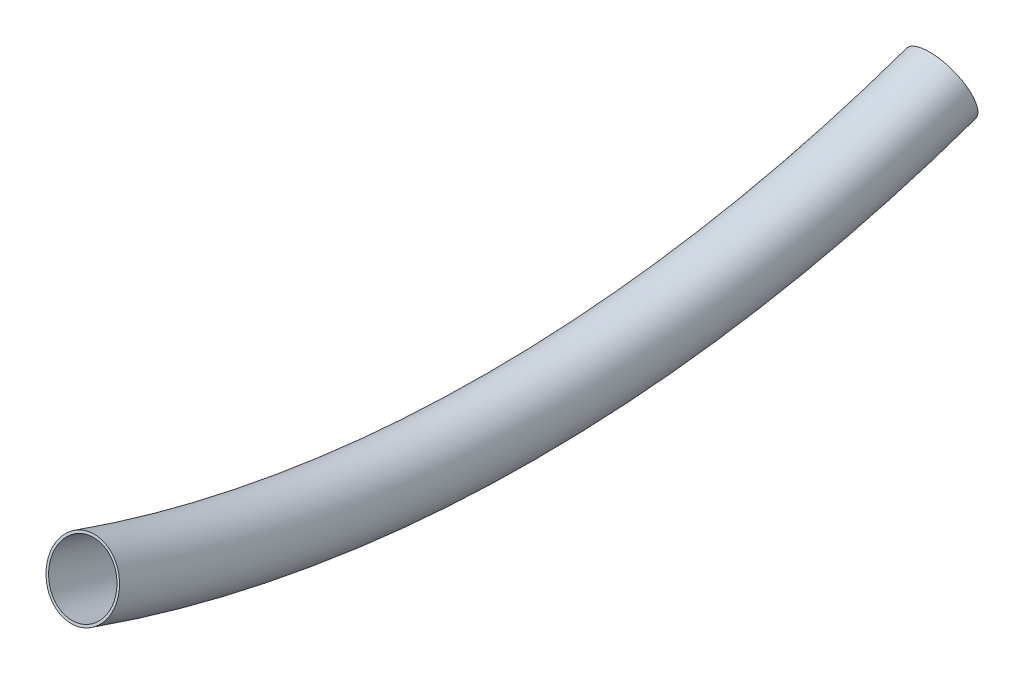
ISO-10303-21;
HEADER;
FILE_DESCRIPTION(('STEP AP214'),'2;1');
FILE_NAME('part.step','',(''),(''),'','','');
FILE_SCHEMA(('AUTOMOTIVE_DESIGN { 1 0 10303 214 1 1 1 1 }'));
ENDSEC;
DATA;
#1=APPLICATION_CONTEXT('core data for automotive mechanical design processes');
#2=APPLICATION_PROTOCOL_DEFINITION('international standard','automotive_design',2000,#1);
#3=PRODUCT_CONTEXT('',#1,'mechanical');
#4=PRODUCT('Part','Part','',(#3));
#5=PRODUCT_RELATED_PRODUCT_CATEGORY('part','',(#4));
#6=PRODUCT_DEFINITION_FORMATION('','',#4);
#7=PRODUCT_DEFINITION_CONTEXT('part definition',#1,'design');
#8=PRODUCT_DEFINITION('design','',#6,#7);
#9=PRODUCT_DEFINITION_SHAPE('','',#8);
#10=(LENGTH_UNIT() NAMED_UNIT(*) SI_UNIT(.MILLI.,.METRE.));
#11=(NAMED_UNIT(*) PLANE_ANGLE_UNIT() SI_UNIT($,.RADIAN.));
#12=(NAMED_UNIT(*) SI_UNIT($,.STERADIAN.) SOLID_ANGLE_UNIT());
#13=UNCERTAINTY_MEASURE_WITH_UNIT(LENGTH_MEASURE(1.E-05),#10,'distance_accuracy_value','');
#14=(GEOMETRIC_REPRESENTATION_CONTEXT(3) GLOBAL_UNCERTAINTY_ASSIGNED_CONTEXT((#13)) GLOBAL_UNIT_ASSIGNED_CONTEXT((#10,
#11,#12)) REPRESENTATION_CONTEXT('',''));
#15=CARTESIAN_POINT('',(0.,0.,0.));
#16=DIRECTION('',(0.,0.,1.));
#17=DIRECTION('',(1.,0.,0.));
#18=AXIS2_PLACEMENT_3D('',#15,#16,#17);
#19=CARTESIAN_POINT('',(2376.6,865.838655439084,0.));
#20=DIRECTION('',(-1.,0.,0.));
#21=DIRECTION('',(0.,0.,1.));
#22=AXIS2_PLACEMENT_3D('',#19,#20,#21);
#23=TOROIDAL_SURFACE('',#22,526.838655439084,13.25);
#24=CARTESIAN_POINT('',(2376.6,369.,-175.243599958301));
#25=DIRECTION('',(0.,0.332632387827062,-0.943056570184666));
#26=DIRECTION('',(0.,0.943056570184666,0.332632387827062));
#27=AXIS2_PLACEMENT_3D('',#24,#25,#26);
#28=CIRCLE('',#27,13.25);
#29=CARTESIAN_POINT('',(2376.6,356.504500445053,-179.65097909701));
#30=VERTEX_POINT('',#29);
#31=EDGE_CURVE('E37',#30,#30,#28,.T.);
#32=CARTESIAN_POINT('',(2376.6,369.,175.243599958301));
#33=DIRECTION('',(0.,-0.332632387827062,-0.943056570184667));
#34=DIRECTION('',(0.,0.943056570184667,-0.332632387827062));
#35=AXIS2_PLACEMENT_3D('',#32,#33,#34);
#36=CIRCLE('',#35,13.25);
#37=CARTESIAN_POINT('',(2376.6,356.504500445053,179.65097909701));
#38=VERTEX_POINT('',#37);
#39=EDGE_CURVE('E45',#38,#38,#36,.T.);
#40=CARTESIAN_POINT('',(2376.6,865.838655439084,0.));
#41=DIRECTION('',(-1.,0.,0.));
#42=DIRECTION('',(0.,0.,1.));
#43=AXIS2_PLACEMENT_3D('',#40,#41,#42);
#44=CIRCLE('',#43,540.088655439084);
#45=EDGE_CURVE('',#30,#38,#44,.T.);
#46=ORIENTED_EDGE('',*,*,#31,.T.);
#47=ORIENTED_EDGE('',*,*,#39,.F.);
#48=ORIENTED_EDGE('',*,*,#45,.T.);
#49=ORIENTED_EDGE('',*,*,#45,.F.);
#50=EDGE_LOOP('',(#46,#48,#47,#49));
#51=FACE_BOUND('',#50,.T.);
#52=ADVANCED_FACE('F30',(#51),#23,.F.);
#53=CARTESIAN_POINT('',(2376.6,865.838655439084,0.));
#54=DIRECTION('',(-1.,0.,0.));
#55=DIRECTION('',(0.,0.,1.));
#56=AXIS2_PLACEMENT_3D('',#53,#54,#55);
#57=TOROIDAL_SURFACE('',#56,526.838655439084,14.25);
#58=CARTESIAN_POINT('',(2376.6,369.,-175.243599958301));
#59=DIRECTION('',(0.,0.332632387827062,-0.943056570184666));
#60=DIRECTION('',(0.,0.943056570184666,0.332632387827062));
#61=AXIS2_PLACEMENT_3D('',#58,#59,#60);
#62=CIRCLE('',#61,14.25);
#63=CARTESIAN_POINT('',(2376.6,355.561443874869,-179.983611484837));
#64=VERTEX_POINT('',#63);
#65=EDGE_CURVE('E10',#64,#64,#62,.T.);
#66=CARTESIAN_POINT('',(2376.6,369.,175.243599958301));
#67=DIRECTION('',(0.,-0.332632387827062,-0.943056570184667));
#68=DIRECTION('',(0.,0.943056570184667,-0.332632387827062));
#69=AXIS2_PLACEMENT_3D('',#66,#67,#68);
#70=CIRCLE('',#69,14.25);
#71=CARTESIAN_POINT('',(2376.6,355.561443874869,179.983611484837));
#72=VERTEX_POINT('',#71);
#73=EDGE_CURVE('E41',#72,#72,#70,.T.);
#74=CARTESIAN_POINT('',(2376.6,865.838655439084,0.));
#75=DIRECTION('',(-1.,0.,0.));
#76=DIRECTION('',(0.,0.,1.));
#77=AXIS2_PLACEMENT_3D('',#74,#75,#76);
#78=CIRCLE('',#77,541.088655439084);
#79=EDGE_CURVE('',#64,#72,#78,.T.);
#80=ORIENTED_EDGE('',*,*,#65,.F.);
#81=ORIENTED_EDGE('',*,*,#73,.T.);
#82=ORIENTED_EDGE('',*,*,#79,.T.);
#83=ORIENTED_EDGE('',*,*,#79,.F.);
#84=EDGE_LOOP('',(#80,#82,#81,#83));
#85=FACE_BOUND('',#84,.T.);
#86=ADVANCED_FACE('F32',(#85),#57,.T.);
#87=CARTESIAN_POINT('',(2376.6,369.,-175.243599958301));
#88=DIRECTION('',(0.,0.332632387827062,-0.943056570184666));
#89=DIRECTION('',(0.,0.943056570184666,0.332632387827062));
#90=AXIS2_PLACEMENT_3D('',#87,#88,#89);
#91=PLANE('',#90);
#92=ORIENTED_EDGE('',*,*,#31,.F.);
#93=EDGE_LOOP('',(#92));
#94=FACE_BOUND('',#93,.T.);
#95=ORIENTED_EDGE('',*,*,#65,.T.);
#96=EDGE_LOOP('',(#95));
#97=FACE_BOUND('',#96,.T.);
#98=ADVANCED_FACE('F58',(#94,#97),#91,.T.);
#99=CARTESIAN_POINT('',(2376.6,369.,175.243599958301));
#100=DIRECTION('',(0.,-0.332632387827062,-0.943056570184667));
#101=DIRECTION('',(0.,0.943056570184667,-0.332632387827062));
#102=AXIS2_PLACEMENT_3D('',#99,#100,#101);
#103=PLANE('',#102);
#104=ORIENTED_EDGE('',*,*,#39,.T.);
#105=EDGE_LOOP('',(#104));
#106=FACE_BOUND('',#105,.T.);
#107=ORIENTED_EDGE('',*,*,#73,.F.);
#108=EDGE_LOOP('',(#107));
#109=FACE_BOUND('',#108,.T.);
#110=ADVANCED_FACE('F51',(#106,#109),#103,.F.);
#111=CLOSED_SHELL('',(#52,#86,#98,#110));
#112=MANIFOLD_SOLID_BREP('B2',#111);
#113=ADVANCED_BREP_SHAPE_REPRESENTATION('',(#18,#112),#14);
#114=SHAPE_DEFINITION_REPRESENTATION(#9,#113);
ENDSEC;
END-ISO-10303-21;
